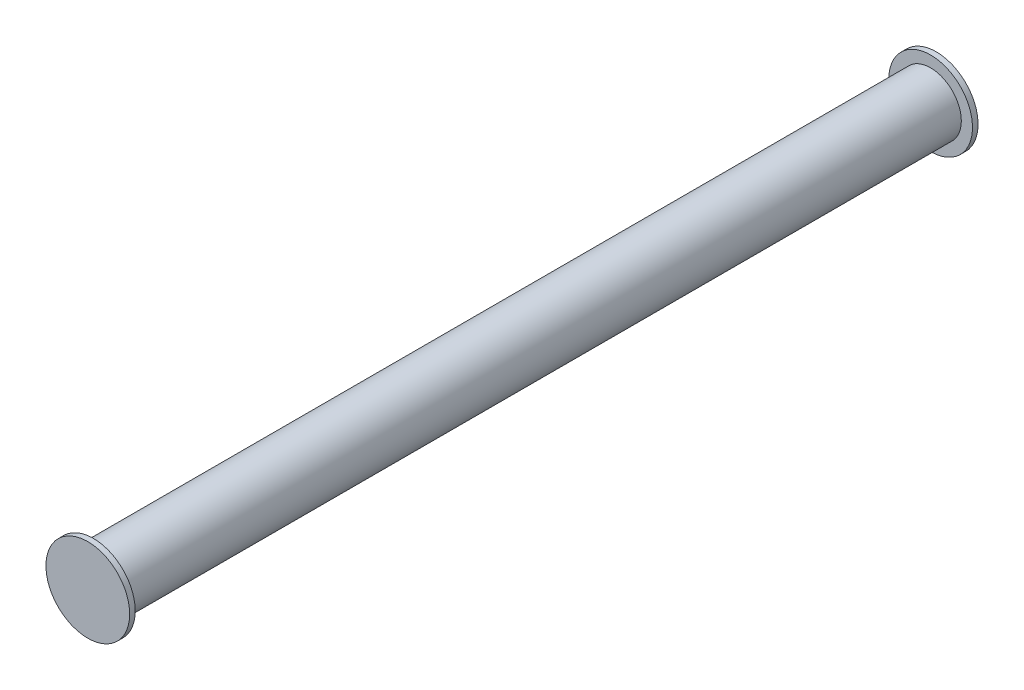
ISO-10303-21;
HEADER;
FILE_DESCRIPTION(('STEP AP214'),'2;1');
FILE_NAME('part.step','',(''),(''),'','','');
FILE_SCHEMA(('AUTOMOTIVE_DESIGN { 1 0 10303 214 1 1 1 1 }'));
ENDSEC;
DATA;
#1=APPLICATION_CONTEXT('core data for automotive mechanical design processes');
#2=APPLICATION_PROTOCOL_DEFINITION('international standard','automotive_design',2000,#1);
#3=PRODUCT_CONTEXT('',#1,'mechanical');
#4=PRODUCT('Part','Part','',(#3));
#5=PRODUCT_RELATED_PRODUCT_CATEGORY('part','',(#4));
#6=PRODUCT_DEFINITION_FORMATION('','',#4);
#7=PRODUCT_DEFINITION_CONTEXT('part definition',#1,'design');
#8=PRODUCT_DEFINITION('design','',#6,#7);
#9=PRODUCT_DEFINITION_SHAPE('','',#8);
#10=(LENGTH_UNIT() NAMED_UNIT(*) SI_UNIT(.MILLI.,.METRE.));
#11=(NAMED_UNIT(*) PLANE_ANGLE_UNIT() SI_UNIT($,.RADIAN.));
#12=(NAMED_UNIT(*) SI_UNIT($,.STERADIAN.) SOLID_ANGLE_UNIT());
#13=UNCERTAINTY_MEASURE_WITH_UNIT(LENGTH_MEASURE(1.E-05),#10,'distance_accuracy_value','');
#14=(GEOMETRIC_REPRESENTATION_CONTEXT(3) GLOBAL_UNCERTAINTY_ASSIGNED_CONTEXT((#13)) GLOBAL_UNIT_ASSIGNED_CONTEXT((#10,
#11,#12)) REPRESENTATION_CONTEXT('',''));
#15=CARTESIAN_POINT('',(0.,0.,0.));
#16=DIRECTION('',(0.,0.,1.));
#17=DIRECTION('',(1.,0.,0.));
#18=AXIS2_PLACEMENT_3D('',#15,#16,#17);
#19=CARTESIAN_POINT('',(0.,0.,150.));
#20=DIRECTION('',(0.,0.,-1.));
#21=DIRECTION('',(-1.,0.,0.));
#22=AXIS2_PLACEMENT_3D('',#19,#20,#21);
#23=CYLINDRICAL_SURFACE('',#22,5.5);
#24=CARTESIAN_POINT('',(0.,0.,150.));
#25=DIRECTION('',(0.,0.,1.));
#26=DIRECTION('',(1.,0.,0.));
#27=AXIS2_PLACEMENT_3D('',#24,#25,#26);
#28=CIRCLE('',#27,5.5);
#29=CARTESIAN_POINT('',(5.5,0.,150.));
#30=VERTEX_POINT('',#29);
#31=EDGE_CURVE('E10',#30,#30,#28,.T.);
#32=ORIENTED_EDGE('',*,*,#31,.F.);
#33=EDGE_LOOP('',(#32));
#34=FACE_BOUND('',#33,.T.);
#35=CARTESIAN_POINT('',(0.,0.,0.));
#36=DIRECTION('',(0.,0.,1.));
#37=DIRECTION('',(1.,0.,0.));
#38=AXIS2_PLACEMENT_3D('',#35,#36,#37);
#39=CIRCLE('',#38,5.5);
#40=CARTESIAN_POINT('',(5.5,0.,0.));
#41=VERTEX_POINT('',#40);
#42=EDGE_CURVE('E40',#41,#41,#39,.T.);
#43=ORIENTED_EDGE('',*,*,#42,.T.);
#44=EDGE_LOOP('',(#43));
#45=FACE_BOUND('',#44,.T.);
#46=ADVANCED_FACE('F37',(#34,#45),#23,.T.);
#47=CARTESIAN_POINT('',(0.,0.,-1.));
#48=DIRECTION('',(0.,0.,1.));
#49=DIRECTION('',(1.,0.,0.));
#50=AXIS2_PLACEMENT_3D('',#47,#48,#49);
#51=CYLINDRICAL_SURFACE('',#50,7.5);
#52=CARTESIAN_POINT('',(0.,0.,-1.));
#53=DIRECTION('',(0.,0.,-1.));
#54=DIRECTION('',(-1.,0.,0.));
#55=AXIS2_PLACEMENT_3D('',#52,#53,#54);
#56=CIRCLE('',#55,7.5);
#57=CARTESIAN_POINT('',(-7.5,0.,-1.));
#58=VERTEX_POINT('',#57);
#59=EDGE_CURVE('E47',#58,#58,#56,.T.);
#60=ORIENTED_EDGE('',*,*,#59,.F.);
#61=EDGE_LOOP('',(#60));
#62=FACE_BOUND('',#61,.T.);
#63=CARTESIAN_POINT('',(0.,0.,0.));
#64=DIRECTION('',(0.,0.,-1.));
#65=DIRECTION('',(-1.,0.,0.));
#66=AXIS2_PLACEMENT_3D('',#63,#64,#65);
#67=CIRCLE('',#66,7.5);
#68=CARTESIAN_POINT('',(-7.5,0.,0.));
#69=VERTEX_POINT('',#68);
#70=EDGE_CURVE('E49',#69,#69,#67,.T.);
#71=ORIENTED_EDGE('',*,*,#70,.T.);
#72=EDGE_LOOP('',(#71));
#73=FACE_BOUND('',#72,.T.);
#74=ADVANCED_FACE('F78',(#62,#73),#51,.T.);
#75=CARTESIAN_POINT('',(0.,0.,-1.));
#76=DIRECTION('',(0.,0.,-1.));
#77=DIRECTION('',(-1.,0.,0.));
#78=AXIS2_PLACEMENT_3D('',#75,#76,#77);
#79=PLANE('',#78);
#80=ORIENTED_EDGE('',*,*,#59,.T.);
#81=EDGE_LOOP('',(#80));
#82=FACE_BOUND('',#81,.T.);
#83=ADVANCED_FACE('F83',(#82),#79,.T.);
#84=CARTESIAN_POINT('',(0.,0.,0.));
#85=DIRECTION('',(0.,0.,-1.));
#86=DIRECTION('',(-1.,0.,0.));
#87=AXIS2_PLACEMENT_3D('',#84,#85,#86);
#88=PLANE('',#87);
#89=ORIENTED_EDGE('',*,*,#42,.F.);
#90=EDGE_LOOP('',(#89));
#91=FACE_BOUND('',#90,.T.);
#92=ORIENTED_EDGE('',*,*,#70,.F.);
#93=EDGE_LOOP('',(#92));
#94=FACE_BOUND('',#93,.T.);
#95=ADVANCED_FACE('F66',(#91,#94),#88,.F.);
#96=CARTESIAN_POINT('',(0.,0.,151.));
#97=DIRECTION('',(0.,0.,-1.));
#98=DIRECTION('',(-1.,0.,0.));
#99=AXIS2_PLACEMENT_3D('',#96,#97,#98);
#100=CYLINDRICAL_SURFACE('',#99,7.5);
#101=CARTESIAN_POINT('',(0.,0.,151.));
#102=DIRECTION('',(0.,0.,1.));
#103=DIRECTION('',(1.,0.,0.));
#104=AXIS2_PLACEMENT_3D('',#101,#102,#103);
#105=CIRCLE('',#104,7.5);
#106=CARTESIAN_POINT('',(7.5,0.,151.));
#107=VERTEX_POINT('',#106);
#108=EDGE_CURVE('E52',#107,#107,#105,.T.);
#109=ORIENTED_EDGE('',*,*,#108,.F.);
#110=EDGE_LOOP('',(#109));
#111=FACE_BOUND('',#110,.T.);
#112=CARTESIAN_POINT('',(0.,0.,150.));
#113=DIRECTION('',(0.,0.,1.));
#114=DIRECTION('',(1.,0.,0.));
#115=AXIS2_PLACEMENT_3D('',#112,#113,#114);
#116=CIRCLE('',#115,7.5);
#117=CARTESIAN_POINT('',(7.5,0.,150.));
#118=VERTEX_POINT('',#117);
#119=EDGE_CURVE('E55',#118,#118,#116,.T.);
#120=ORIENTED_EDGE('',*,*,#119,.T.);
#121=EDGE_LOOP('',(#120));
#122=FACE_BOUND('',#121,.T.);
#123=ADVANCED_FACE('F63',(#111,#122),#100,.T.);
#124=CARTESIAN_POINT('',(0.,0.,151.));
#125=DIRECTION('',(0.,0.,1.));
#126=DIRECTION('',(1.,0.,0.));
#127=AXIS2_PLACEMENT_3D('',#124,#125,#126);
#128=PLANE('',#127);
#129=ORIENTED_EDGE('',*,*,#108,.T.);
#130=EDGE_LOOP('',(#129));
#131=FACE_BOUND('',#130,.T.);
#132=ADVANCED_FACE('F61',(#131),#128,.T.);
#133=CARTESIAN_POINT('',(0.,0.,150.));
#134=DIRECTION('',(0.,0.,1.));
#135=DIRECTION('',(1.,0.,0.));
#136=AXIS2_PLACEMENT_3D('',#133,#134,#135);
#137=PLANE('',#136);
#138=ORIENTED_EDGE('',*,*,#31,.T.);
#139=EDGE_LOOP('',(#138));
#140=FACE_BOUND('',#139,.T.);
#141=ORIENTED_EDGE('',*,*,#119,.F.);
#142=EDGE_LOOP('',(#141));
#143=FACE_BOUND('',#142,.T.);
#144=ADVANCED_FACE('F70',(#140,#143),#137,.F.);
#145=CLOSED_SHELL('',(#46,#74,#83,#95,#123,#132,#144));
#146=MANIFOLD_SOLID_BREP('B2',#145);
#147=ADVANCED_BREP_SHAPE_REPRESENTATION('',(#18,#146),#14);
#148=SHAPE_DEFINITION_REPRESENTATION(#9,#147);
ENDSEC;
END-ISO-10303-21;
